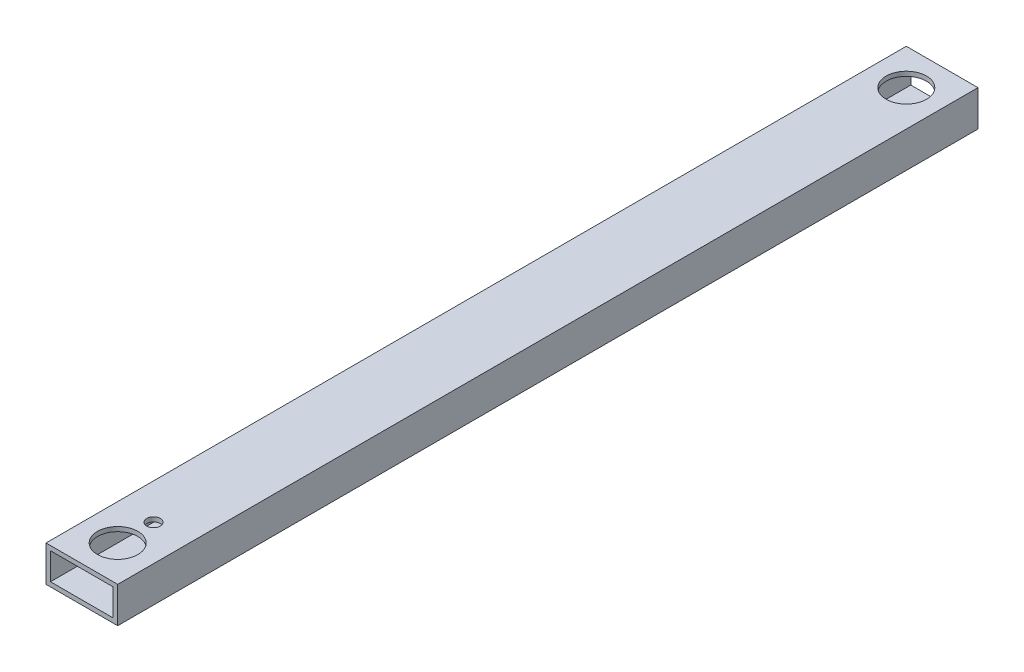
ISO-10303-21;
HEADER;
FILE_DESCRIPTION(('STEP AP214'),'2;1');
FILE_NAME('part.step','',(''),(''),'','','');
FILE_SCHEMA(('AUTOMOTIVE_DESIGN { 1 0 10303 214 1 1 1 1 }'));
ENDSEC;
DATA;
#1=APPLICATION_CONTEXT('core data for automotive mechanical design processes');
#2=APPLICATION_PROTOCOL_DEFINITION('international standard','automotive_design',2000,#1);
#3=PRODUCT_CONTEXT('',#1,'mechanical');
#4=PRODUCT('Part','Part','',(#3));
#5=PRODUCT_RELATED_PRODUCT_CATEGORY('part','',(#4));
#6=PRODUCT_DEFINITION_FORMATION('','',#4);
#7=PRODUCT_DEFINITION_CONTEXT('part definition',#1,'design');
#8=PRODUCT_DEFINITION('design','',#6,#7);
#9=PRODUCT_DEFINITION_SHAPE('','',#8);
#10=(LENGTH_UNIT() NAMED_UNIT(*) SI_UNIT(.MILLI.,.METRE.));
#11=(NAMED_UNIT(*) PLANE_ANGLE_UNIT() SI_UNIT($,.RADIAN.));
#12=(NAMED_UNIT(*) SI_UNIT($,.STERADIAN.) SOLID_ANGLE_UNIT());
#13=UNCERTAINTY_MEASURE_WITH_UNIT(LENGTH_MEASURE(1.E-05),#10,'distance_accuracy_value','');
#14=(GEOMETRIC_REPRESENTATION_CONTEXT(3) GLOBAL_UNCERTAINTY_ASSIGNED_CONTEXT((#13)) GLOBAL_UNIT_ASSIGNED_CONTEXT((#10,
#11,#12)) REPRESENTATION_CONTEXT('',''));
#15=CARTESIAN_POINT('',(0.,0.,0.));
#16=DIRECTION('',(0.,0.,1.));
#17=DIRECTION('',(1.,0.,0.));
#18=AXIS2_PLACEMENT_3D('',#15,#16,#17);
#19=CARTESIAN_POINT('',(0.,0.,609.6));
#20=DIRECTION('',(1.,0.,0.));
#21=DIRECTION('',(0.,0.,-1.));
#22=AXIS2_PLACEMENT_3D('',#19,#20,#21);
#23=PLANE('',#22);
#24=DIRECTION('',(0.,-1.,0.));
#25=VECTOR('',#24,1.);
#26=CARTESIAN_POINT('',(0.,0.,0.));
#27=LINE('',#26,#25);
#28=CARTESIAN_POINT('',(0.,25.4,0.));
#29=VERTEX_POINT('',#28);
#30=CARTESIAN_POINT('',(0.,0.,0.));
#31=VERTEX_POINT('',#30);
#32=EDGE_CURVE('E135',#29,#31,#27,.T.);
#33=ORIENTED_EDGE('',*,*,#32,.T.);
#34=DIRECTION('',(0.,0.,-1.));
#35=VECTOR('',#34,1.);
#36=CARTESIAN_POINT('',(0.,0.,609.6));
#37=LINE('',#36,#35);
#38=CARTESIAN_POINT('',(0.,0.,609.6));
#39=VERTEX_POINT('',#38);
#40=EDGE_CURVE('E11',#39,#31,#37,.T.);
#41=ORIENTED_EDGE('',*,*,#40,.F.);
#42=DIRECTION('',(0.,-1.,0.));
#43=VECTOR('',#42,1.);
#44=CARTESIAN_POINT('',(0.,0.,609.6));
#45=LINE('',#44,#43);
#46=CARTESIAN_POINT('',(0.,25.4,609.6));
#47=VERTEX_POINT('',#46);
#48=EDGE_CURVE('E136',#47,#39,#45,.T.);
#49=ORIENTED_EDGE('',*,*,#48,.F.);
#50=DIRECTION('',(0.,0.,-1.));
#51=VECTOR('',#50,1.);
#52=CARTESIAN_POINT('',(0.,25.4,609.6));
#53=LINE('',#52,#51);
#54=EDGE_CURVE('E146',#47,#29,#53,.T.);
#55=ORIENTED_EDGE('',*,*,#54,.T.);
#56=EDGE_LOOP('',(#33,#41,#49,#55));
#57=FACE_BOUND('',#56,.T.);
#58=ADVANCED_FACE('F33',(#57),#23,.F.);
#59=CARTESIAN_POINT('',(0.,0.,609.6));
#60=DIRECTION('',(0.,1.,0.));
#61=DIRECTION('',(0.,0.,1.));
#62=AXIS2_PLACEMENT_3D('',#59,#60,#61);
#63=PLANE('',#62);
#64=CARTESIAN_POINT('',(25.4,0.,558.8));
#65=DIRECTION('',(0.,-1.,0.));
#66=DIRECTION('',(0.,0.,-1.));
#67=AXIS2_PLACEMENT_3D('',#64,#65,#66);
#68=CIRCLE('',#67,4.76250000000002);
#69=CARTESIAN_POINT('',(25.4,0.,554.0375));
#70=VERTEX_POINT('',#69);
#71=EDGE_CURVE('E226',#70,#70,#68,.T.);
#72=ORIENTED_EDGE('',*,*,#71,.F.);
#73=EDGE_LOOP('',(#72));
#74=FACE_BOUND('',#73,.T.);
#75=DIRECTION('',(1.,0.,0.));
#76=VECTOR('',#75,1.);
#77=CARTESIAN_POINT('',(0.,0.,0.));
#78=LINE('',#77,#76);
#79=CARTESIAN_POINT('',(50.8,0.,0.));
#80=VERTEX_POINT('',#79);
#81=EDGE_CURVE('E149',#31,#80,#78,.T.);
#82=ORIENTED_EDGE('',*,*,#81,.T.);
#83=DIRECTION('',(0.,0.,-1.));
#84=VECTOR('',#83,1.);
#85=CARTESIAN_POINT('',(50.8,0.,609.6));
#86=LINE('',#85,#84);
#87=CARTESIAN_POINT('',(50.8,0.,609.6));
#88=VERTEX_POINT('',#87);
#89=EDGE_CURVE('E41',#88,#80,#86,.T.);
#90=ORIENTED_EDGE('',*,*,#89,.F.);
#91=DIRECTION('',(1.,0.,0.));
#92=VECTOR('',#91,1.);
#93=CARTESIAN_POINT('',(0.,0.,609.6));
#94=LINE('',#93,#92);
#95=EDGE_CURVE('E139',#39,#88,#94,.T.);
#96=ORIENTED_EDGE('',*,*,#95,.F.);
#97=ORIENTED_EDGE('',*,*,#40,.T.);
#98=EDGE_LOOP('',(#82,#90,#96,#97));
#99=FACE_BOUND('',#98,.T.);
#100=ADVANCED_FACE('F178',(#74,#99),#63,.F.);
#101=CARTESIAN_POINT('',(50.8,0.,609.6));
#102=DIRECTION('',(-1.,0.,0.));
#103=DIRECTION('',(0.,0.,1.));
#104=AXIS2_PLACEMENT_3D('',#101,#102,#103);
#105=PLANE('',#104);
#106=DIRECTION('',(0.,1.,0.));
#107=VECTOR('',#106,1.);
#108=CARTESIAN_POINT('',(50.8,0.,0.));
#109=LINE('',#108,#107);
#110=CARTESIAN_POINT('',(50.8,25.4,0.));
#111=VERTEX_POINT('',#110);
#112=EDGE_CURVE('E151',#80,#111,#109,.T.);
#113=ORIENTED_EDGE('',*,*,#112,.T.);
#114=DIRECTION('',(0.,0.,-1.));
#115=VECTOR('',#114,1.);
#116=CARTESIAN_POINT('',(50.8,25.4,609.6));
#117=LINE('',#116,#115);
#118=CARTESIAN_POINT('',(50.8,25.4,609.6));
#119=VERTEX_POINT('',#118);
#120=EDGE_CURVE('E156',#119,#111,#117,.T.);
#121=ORIENTED_EDGE('',*,*,#120,.F.);
#122=DIRECTION('',(0.,1.,0.));
#123=VECTOR('',#122,1.);
#124=CARTESIAN_POINT('',(50.8,0.,609.6));
#125=LINE('',#124,#123);
#126=EDGE_CURVE('E142',#88,#119,#125,.T.);
#127=ORIENTED_EDGE('',*,*,#126,.F.);
#128=ORIENTED_EDGE('',*,*,#89,.T.);
#129=EDGE_LOOP('',(#113,#121,#127,#128));
#130=FACE_BOUND('',#129,.T.);
#131=ADVANCED_FACE('F164',(#130),#105,.F.);
#132=CARTESIAN_POINT('',(0.,25.4,609.6));
#133=DIRECTION('',(0.,-1.,0.));
#134=DIRECTION('',(0.,0.,-1.));
#135=AXIS2_PLACEMENT_3D('',#132,#133,#134);
#136=PLANE('',#135);
#137=CARTESIAN_POINT('',(25.4,25.4,558.8));
#138=DIRECTION('',(0.,-1.,0.));
#139=DIRECTION('',(0.,0.,-1.));
#140=AXIS2_PLACEMENT_3D('',#137,#138,#139);
#141=CIRCLE('',#140,4.76250000000002);
#142=CARTESIAN_POINT('',(25.4,25.4,554.0375));
#143=VERTEX_POINT('',#142);
#144=EDGE_CURVE('E236',#143,#143,#141,.T.);
#145=ORIENTED_EDGE('',*,*,#144,.T.);
#146=EDGE_LOOP('',(#145));
#147=FACE_BOUND('',#146,.T.);
#148=CARTESIAN_POINT('',(25.4,25.4,584.2));
#149=DIRECTION('',(0.,1.,0.));
#150=DIRECTION('',(0.,0.,1.));
#151=AXIS2_PLACEMENT_3D('',#148,#149,#150);
#152=CIRCLE('',#151,14.2875);
#153=CARTESIAN_POINT('',(25.4,25.4,598.4875));
#154=VERTEX_POINT('',#153);
#155=EDGE_CURVE('E230',#154,#154,#152,.T.);
#156=ORIENTED_EDGE('',*,*,#155,.F.);
#157=EDGE_LOOP('',(#156));
#158=FACE_BOUND('',#157,.T.);
#159=CARTESIAN_POINT('',(25.4,25.4,25.4));
#160=DIRECTION('',(0.,1.,0.));
#161=DIRECTION('',(0.,0.,1.));
#162=AXIS2_PLACEMENT_3D('',#159,#160,#161);
#163=CIRCLE('',#162,14.2875);
#164=CARTESIAN_POINT('',(25.4,25.4,39.6875));
#165=VERTEX_POINT('',#164);
#166=EDGE_CURVE('E241',#165,#165,#163,.T.);
#167=ORIENTED_EDGE('',*,*,#166,.F.);
#168=EDGE_LOOP('',(#167));
#169=FACE_BOUND('',#168,.T.);
#170=DIRECTION('',(-1.,0.,0.));
#171=VECTOR('',#170,1.);
#172=CARTESIAN_POINT('',(0.,25.4,0.));
#173=LINE('',#172,#171);
#174=EDGE_CURVE('E140',#111,#29,#173,.T.);
#175=ORIENTED_EDGE('',*,*,#174,.T.);
#176=ORIENTED_EDGE('',*,*,#54,.F.);
#177=DIRECTION('',(-1.,0.,0.));
#178=VECTOR('',#177,1.);
#179=CARTESIAN_POINT('',(0.,25.4,609.6));
#180=LINE('',#179,#178);
#181=EDGE_CURVE('E144',#119,#47,#180,.T.);
#182=ORIENTED_EDGE('',*,*,#181,.F.);
#183=ORIENTED_EDGE('',*,*,#120,.T.);
#184=EDGE_LOOP('',(#175,#176,#182,#183));
#185=FACE_BOUND('',#184,.T.);
#186=ADVANCED_FACE('F171',(#147,#158,#169,#185),#136,.F.);
#187=CARTESIAN_POINT('',(0.,0.,609.6));
#188=DIRECTION('',(0.,0.,-1.));
#189=DIRECTION('',(-1.,0.,0.));
#190=AXIS2_PLACEMENT_3D('',#187,#188,#189);
#191=PLANE('',#190);
#192=DIRECTION('',(-1.,0.,0.));
#193=VECTOR('',#192,1.);
#194=CARTESIAN_POINT('',(0.,3.175,609.6));
#195=LINE('',#194,#193);
#196=CARTESIAN_POINT('',(47.625,3.175,609.6));
#197=VERTEX_POINT('',#196);
#198=CARTESIAN_POINT('',(3.175,3.175,609.6));
#199=VERTEX_POINT('',#198);
#200=EDGE_CURVE('E129',#197,#199,#195,.T.);
#201=ORIENTED_EDGE('',*,*,#200,.T.);
#202=DIRECTION('',(0.,1.,0.));
#203=VECTOR('',#202,1.);
#204=CARTESIAN_POINT('',(3.175,0.,609.6));
#205=LINE('',#204,#203);
#206=CARTESIAN_POINT('',(3.175,22.225,609.6));
#207=VERTEX_POINT('',#206);
#208=EDGE_CURVE('E132',#199,#207,#205,.T.);
#209=ORIENTED_EDGE('',*,*,#208,.T.);
#210=DIRECTION('',(1.,0.,0.));
#211=VECTOR('',#210,1.);
#212=CARTESIAN_POINT('',(0.,22.225,609.6));
#213=LINE('',#212,#211);
#214=CARTESIAN_POINT('',(47.625,22.225,609.6));
#215=VERTEX_POINT('',#214);
#216=EDGE_CURVE('E124',#207,#215,#213,.T.);
#217=ORIENTED_EDGE('',*,*,#216,.T.);
#218=DIRECTION('',(0.,-1.,0.));
#219=VECTOR('',#218,1.);
#220=CARTESIAN_POINT('',(47.625,0.,609.6));
#221=LINE('',#220,#219);
#222=EDGE_CURVE('E104',#215,#197,#221,.T.);
#223=ORIENTED_EDGE('',*,*,#222,.T.);
#224=EDGE_LOOP('',(#201,#209,#217,#223));
#225=FACE_BOUND('',#224,.T.);
#226=ORIENTED_EDGE('',*,*,#48,.T.);
#227=ORIENTED_EDGE('',*,*,#95,.T.);
#228=ORIENTED_EDGE('',*,*,#126,.T.);
#229=ORIENTED_EDGE('',*,*,#181,.T.);
#230=EDGE_LOOP('',(#226,#227,#228,#229));
#231=FACE_BOUND('',#230,.T.);
#232=ADVANCED_FACE('F177',(#225,#231),#191,.F.);
#233=CARTESIAN_POINT('',(0.,0.,0.));
#234=DIRECTION('',(0.,0.,-1.));
#235=DIRECTION('',(-1.,0.,0.));
#236=AXIS2_PLACEMENT_3D('',#233,#234,#235);
#237=PLANE('',#236);
#238=DIRECTION('',(0.,1.,0.));
#239=VECTOR('',#238,1.);
#240=CARTESIAN_POINT('',(3.175,3.175,0.));
#241=LINE('',#240,#239);
#242=CARTESIAN_POINT('',(3.175,3.175,0.));
#243=VERTEX_POINT('',#242);
#244=CARTESIAN_POINT('',(3.175,22.225,0.));
#245=VERTEX_POINT('',#244);
#246=EDGE_CURVE('E56',#243,#245,#241,.T.);
#247=ORIENTED_EDGE('',*,*,#246,.F.);
#248=DIRECTION('',(-1.,0.,0.));
#249=VECTOR('',#248,1.);
#250=CARTESIAN_POINT('',(3.175,3.175,0.));
#251=LINE('',#250,#249);
#252=CARTESIAN_POINT('',(47.625,3.175,0.));
#253=VERTEX_POINT('',#252);
#254=EDGE_CURVE('E117',#253,#243,#251,.T.);
#255=ORIENTED_EDGE('',*,*,#254,.F.);
#256=DIRECTION('',(0.,-1.,0.));
#257=VECTOR('',#256,1.);
#258=CARTESIAN_POINT('',(47.625,3.175,0.));
#259=LINE('',#258,#257);
#260=CARTESIAN_POINT('',(47.625,22.225,0.));
#261=VERTEX_POINT('',#260);
#262=EDGE_CURVE('E101',#261,#253,#259,.T.);
#263=ORIENTED_EDGE('',*,*,#262,.F.);
#264=DIRECTION('',(1.,0.,0.));
#265=VECTOR('',#264,1.);
#266=CARTESIAN_POINT('',(3.175,22.225,0.));
#267=LINE('',#266,#265);
#268=EDGE_CURVE('E110',#245,#261,#267,.T.);
#269=ORIENTED_EDGE('',*,*,#268,.F.);
#270=EDGE_LOOP('',(#247,#255,#263,#269));
#271=FACE_BOUND('',#270,.T.);
#272=ORIENTED_EDGE('',*,*,#32,.F.);
#273=ORIENTED_EDGE('',*,*,#174,.F.);
#274=ORIENTED_EDGE('',*,*,#112,.F.);
#275=ORIENTED_EDGE('',*,*,#81,.F.);
#276=EDGE_LOOP('',(#272,#273,#274,#275));
#277=FACE_BOUND('',#276,.T.);
#278=ADVANCED_FACE('F114',(#271,#277),#237,.T.);
#279=CARTESIAN_POINT('',(3.175,3.175,635.));
#280=DIRECTION('',(-1.,0.,0.));
#281=DIRECTION('',(0.,0.,1.));
#282=AXIS2_PLACEMENT_3D('',#279,#280,#281);
#283=PLANE('',#282);
#284=DIRECTION('',(0.,0.,-1.));
#285=VECTOR('',#284,1.);
#286=CARTESIAN_POINT('',(3.175,3.175,635.));
#287=LINE('',#286,#285);
#288=EDGE_CURVE('E122',#199,#243,#287,.T.);
#289=ORIENTED_EDGE('',*,*,#288,.T.);
#290=ORIENTED_EDGE('',*,*,#246,.T.);
#291=DIRECTION('',(0.,0.,-1.));
#292=VECTOR('',#291,1.);
#293=CARTESIAN_POINT('',(3.175,22.225,635.));
#294=LINE('',#293,#292);
#295=EDGE_CURVE('E107',#207,#245,#294,.T.);
#296=ORIENTED_EDGE('',*,*,#295,.F.);
#297=ORIENTED_EDGE('',*,*,#208,.F.);
#298=EDGE_LOOP('',(#289,#290,#296,#297));
#299=FACE_BOUND('',#298,.T.);
#300=ADVANCED_FACE('F193',(#299),#283,.F.);
#301=CARTESIAN_POINT('',(3.175,3.175,635.));
#302=DIRECTION('',(0.,-1.,0.));
#303=DIRECTION('',(0.,0.,-1.));
#304=AXIS2_PLACEMENT_3D('',#301,#302,#303);
#305=PLANE('',#304);
#306=CARTESIAN_POINT('',(25.4,3.175,558.8));
#307=DIRECTION('',(0.,-1.,0.));
#308=DIRECTION('',(0.,0.,-1.));
#309=AXIS2_PLACEMENT_3D('',#306,#307,#308);
#310=CIRCLE('',#309,4.76250000000002);
#311=CARTESIAN_POINT('',(25.4,3.175,554.0375));
#312=VERTEX_POINT('',#311);
#313=EDGE_CURVE('E229',#312,#312,#310,.T.);
#314=ORIENTED_EDGE('',*,*,#313,.T.);
#315=EDGE_LOOP('',(#314));
#316=FACE_BOUND('',#315,.T.);
#317=DIRECTION('',(0.,0.,-1.));
#318=VECTOR('',#317,1.);
#319=CARTESIAN_POINT('',(47.625,3.175,635.));
#320=LINE('',#319,#318);
#321=EDGE_CURVE('E106',#197,#253,#320,.T.);
#322=ORIENTED_EDGE('',*,*,#321,.T.);
#323=ORIENTED_EDGE('',*,*,#254,.T.);
#324=ORIENTED_EDGE('',*,*,#288,.F.);
#325=ORIENTED_EDGE('',*,*,#200,.F.);
#326=EDGE_LOOP('',(#322,#323,#324,#325));
#327=FACE_BOUND('',#326,.T.);
#328=ADVANCED_FACE('F199',(#316,#327),#305,.F.);
#329=CARTESIAN_POINT('',(47.625,3.175,635.));
#330=DIRECTION('',(1.,0.,0.));
#331=DIRECTION('',(0.,0.,-1.));
#332=AXIS2_PLACEMENT_3D('',#329,#330,#331);
#333=PLANE('',#332);
#334=DIRECTION('',(0.,0.,-1.));
#335=VECTOR('',#334,1.);
#336=CARTESIAN_POINT('',(47.625,22.225,635.));
#337=LINE('',#336,#335);
#338=EDGE_CURVE('E48',#215,#261,#337,.T.);
#339=ORIENTED_EDGE('',*,*,#338,.T.);
#340=ORIENTED_EDGE('',*,*,#262,.T.);
#341=ORIENTED_EDGE('',*,*,#321,.F.);
#342=ORIENTED_EDGE('',*,*,#222,.F.);
#343=EDGE_LOOP('',(#339,#340,#341,#342));
#344=FACE_BOUND('',#343,.T.);
#345=ADVANCED_FACE('F98',(#344),#333,.F.);
#346=CARTESIAN_POINT('',(3.175,22.225,635.));
#347=DIRECTION('',(0.,1.,0.));
#348=DIRECTION('',(0.,0.,1.));
#349=AXIS2_PLACEMENT_3D('',#346,#347,#348);
#350=PLANE('',#349);
#351=CARTESIAN_POINT('',(25.4,22.225,558.8));
#352=DIRECTION('',(0.,1.,0.));
#353=DIRECTION('',(0.,0.,1.));
#354=AXIS2_PLACEMENT_3D('',#351,#352,#353);
#355=CIRCLE('',#354,4.76250000000002);
#356=CARTESIAN_POINT('',(25.4,22.225,563.5625));
#357=VERTEX_POINT('',#356);
#358=EDGE_CURVE('E36',#357,#357,#355,.T.);
#359=ORIENTED_EDGE('',*,*,#358,.T.);
#360=EDGE_LOOP('',(#359));
#361=FACE_BOUND('',#360,.T.);
#362=CARTESIAN_POINT('',(25.4,22.225,584.2));
#363=DIRECTION('',(0.,1.,0.));
#364=DIRECTION('',(0.,0.,1.));
#365=AXIS2_PLACEMENT_3D('',#362,#363,#364);
#366=CIRCLE('',#365,14.2875);
#367=CARTESIAN_POINT('',(25.4,22.225,598.4875));
#368=VERTEX_POINT('',#367);
#369=EDGE_CURVE('E233',#368,#368,#366,.T.);
#370=ORIENTED_EDGE('',*,*,#369,.T.);
#371=EDGE_LOOP('',(#370));
#372=FACE_BOUND('',#371,.T.);
#373=CARTESIAN_POINT('',(25.4,22.225,25.4));
#374=DIRECTION('',(0.,1.,0.));
#375=DIRECTION('',(0.,0.,1.));
#376=AXIS2_PLACEMENT_3D('',#373,#374,#375);
#377=CIRCLE('',#376,14.2875);
#378=CARTESIAN_POINT('',(25.4,22.225,39.6875));
#379=VERTEX_POINT('',#378);
#380=EDGE_CURVE('E243',#379,#379,#377,.T.);
#381=ORIENTED_EDGE('',*,*,#380,.T.);
#382=EDGE_LOOP('',(#381));
#383=FACE_BOUND('',#382,.T.);
#384=ORIENTED_EDGE('',*,*,#295,.T.);
#385=ORIENTED_EDGE('',*,*,#268,.T.);
#386=ORIENTED_EDGE('',*,*,#338,.F.);
#387=ORIENTED_EDGE('',*,*,#216,.F.);
#388=EDGE_LOOP('',(#384,#385,#386,#387));
#389=FACE_BOUND('',#388,.T.);
#390=ADVANCED_FACE('F111',(#361,#372,#383,#389),#350,.F.);
#391=CARTESIAN_POINT('',(25.4,22.225,25.4));
#392=DIRECTION('',(0.,1.,0.));
#393=DIRECTION('',(0.,0.,1.));
#394=AXIS2_PLACEMENT_3D('',#391,#392,#393);
#395=CYLINDRICAL_SURFACE('',#394,14.2875);
#396=ORIENTED_EDGE('',*,*,#380,.F.);
#397=EDGE_LOOP('',(#396));
#398=FACE_BOUND('',#397,.T.);
#399=ORIENTED_EDGE('',*,*,#166,.T.);
#400=EDGE_LOOP('',(#399));
#401=FACE_BOUND('',#400,.T.);
#402=ADVANCED_FACE('F202',(#398,#401),#395,.F.);
#403=CARTESIAN_POINT('',(25.4,22.225,584.2));
#404=DIRECTION('',(0.,1.,0.));
#405=DIRECTION('',(0.,0.,1.));
#406=AXIS2_PLACEMENT_3D('',#403,#404,#405);
#407=CYLINDRICAL_SURFACE('',#406,14.2875);
#408=ORIENTED_EDGE('',*,*,#369,.F.);
#409=EDGE_LOOP('',(#408));
#410=FACE_BOUND('',#409,.T.);
#411=ORIENTED_EDGE('',*,*,#155,.T.);
#412=EDGE_LOOP('',(#411));
#413=FACE_BOUND('',#412,.T.);
#414=ADVANCED_FACE('F211',(#410,#413),#407,.F.);
#415=CARTESIAN_POINT('',(25.4,25.4,558.8));
#416=DIRECTION('',(0.,-1.,0.));
#417=DIRECTION('',(0.,0.,-1.));
#418=AXIS2_PLACEMENT_3D('',#415,#416,#417);
#419=CYLINDRICAL_SURFACE('',#418,4.76250000000002);
#420=ORIENTED_EDGE('',*,*,#144,.F.);
#421=EDGE_LOOP('',(#420));
#422=FACE_BOUND('',#421,.T.);
#423=ORIENTED_EDGE('',*,*,#358,.F.);
#424=EDGE_LOOP('',(#423));
#425=FACE_BOUND('',#424,.T.);
#426=ADVANCED_FACE('F215',(#422,#425),#419,.F.);
#427=ORIENTED_EDGE('',*,*,#71,.T.);
#428=EDGE_LOOP('',(#427));
#429=FACE_BOUND('',#428,.T.);
#430=ORIENTED_EDGE('',*,*,#313,.F.);
#431=EDGE_LOOP('',(#430));
#432=FACE_BOUND('',#431,.T.);
#433=ADVANCED_FACE('F217',(#429,#432),#419,.F.);
#434=CLOSED_SHELL('',(#58,#100,#131,#186,#232,#278,#300,#328,#345,#390,#402,#414,#426,#433));
#435=MANIFOLD_SOLID_BREP('B2',#434);
#436=ADVANCED_BREP_SHAPE_REPRESENTATION('',(#18,#435),#14);
#437=SHAPE_DEFINITION_REPRESENTATION(#9,#436);
ENDSEC;
END-ISO-10303-21;
